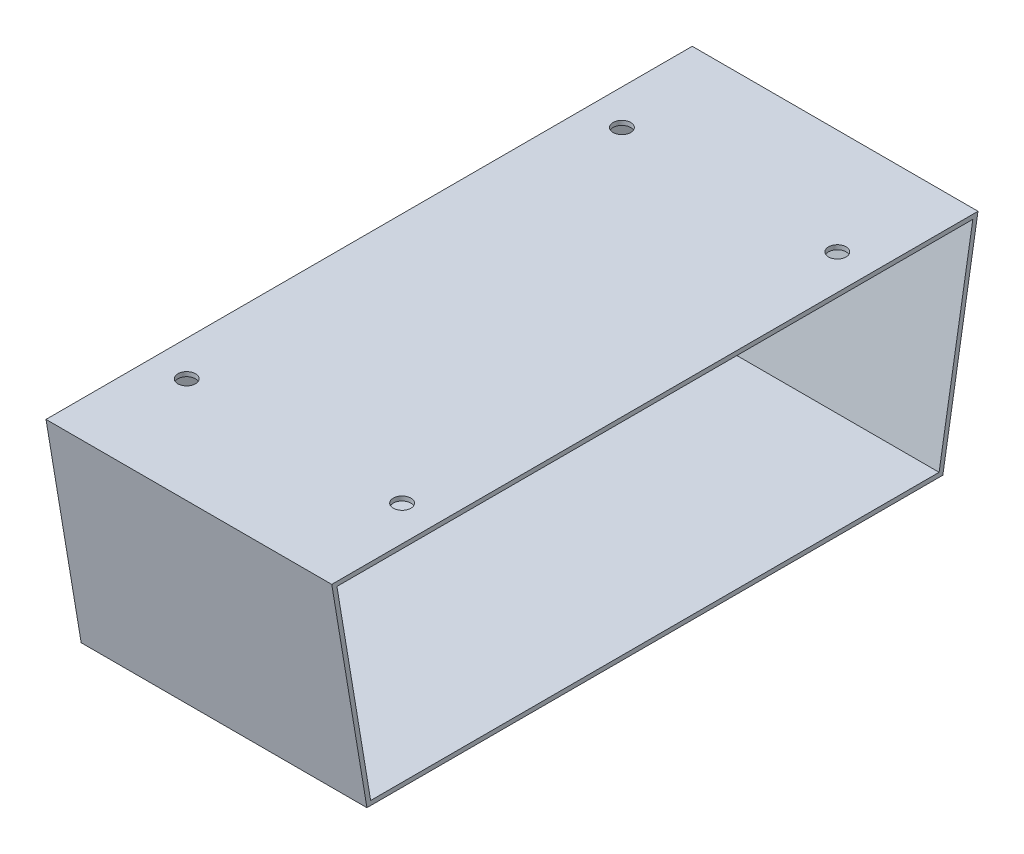
ISO-10303-21;
HEADER;
FILE_DESCRIPTION(('STEP AP214'),'2;1');
FILE_NAME('part.step','',(''),(''),'','','');
FILE_SCHEMA(('AUTOMOTIVE_DESIGN { 1 0 10303 214 1 1 1 1 }'));
ENDSEC;
DATA;
#1=APPLICATION_CONTEXT('core data for automotive mechanical design processes');
#2=APPLICATION_PROTOCOL_DEFINITION('international standard','automotive_design',2000,#1);
#3=PRODUCT_CONTEXT('',#1,'mechanical');
#4=PRODUCT('Part','Part','',(#3));
#5=PRODUCT_RELATED_PRODUCT_CATEGORY('part','',(#4));
#6=PRODUCT_DEFINITION_FORMATION('','',#4);
#7=PRODUCT_DEFINITION_CONTEXT('part definition',#1,'design');
#8=PRODUCT_DEFINITION('design','',#6,#7);
#9=PRODUCT_DEFINITION_SHAPE('','',#8);
#10=(LENGTH_UNIT() NAMED_UNIT(*) SI_UNIT(.MILLI.,.METRE.));
#11=(NAMED_UNIT(*) PLANE_ANGLE_UNIT() SI_UNIT($,.RADIAN.));
#12=(NAMED_UNIT(*) SI_UNIT($,.STERADIAN.) SOLID_ANGLE_UNIT());
#13=UNCERTAINTY_MEASURE_WITH_UNIT(LENGTH_MEASURE(1.E-05),#10,'distance_accuracy_value','');
#14=(GEOMETRIC_REPRESENTATION_CONTEXT(3) GLOBAL_UNCERTAINTY_ASSIGNED_CONTEXT((#13)) GLOBAL_UNIT_ASSIGNED_CONTEXT((#10,
#11,#12)) REPRESENTATION_CONTEXT('',''));
#15=CARTESIAN_POINT('',(0.,0.,0.));
#16=DIRECTION('',(0.,0.,1.));
#17=DIRECTION('',(1.,0.,0.));
#18=AXIS2_PLACEMENT_3D('',#15,#16,#17);
#19=CARTESIAN_POINT('',(3.175,16.7486577181208,-57.6081375838925));
#20=DIRECTION('',(0.,1.,0.));
#21=DIRECTION('',(0.,0.,1.));
#22=AXIS2_PLACEMENT_3D('',#19,#20,#21);
#23=PLANE('',#22);
#24=DIRECTION('',(0.,0.,-1.));
#25=VECTOR('',#24,1.);
#26=CARTESIAN_POINT('',(0.,16.7486577181208,-57.6081375838925));
#27=LINE('',#26,#25);
#28=CARTESIAN_POINT('',(0.,16.7486577181208,358.316862416107));
#29=VERTEX_POINT('',#28);
#30=CARTESIAN_POINT('',(0.,16.7486577181208,-57.6081375838925));
#31=VERTEX_POINT('',#30);
#32=EDGE_CURVE('E153',#29,#31,#27,.T.);
#33=ORIENTED_EDGE('',*,*,#32,.T.);
#34=DIRECTION('',(-1.,0.,0.));
#35=VECTOR('',#34,1.);
#36=CARTESIAN_POINT('',(3.175,16.7486577181208,-57.6081375838925));
#37=LINE('',#36,#35);
#38=CARTESIAN_POINT('',(206.375,16.7486577181208,-57.6081375838925));
#39=VERTEX_POINT('',#38);
#40=EDGE_CURVE('E11',#39,#31,#37,.T.);
#41=ORIENTED_EDGE('',*,*,#40,.F.);
#42=DIRECTION('',(0.,0.,-1.));
#43=VECTOR('',#42,1.);
#44=CARTESIAN_POINT('',(206.375,16.7486577181208,358.316862416107));
#45=LINE('',#44,#43);
#46=CARTESIAN_POINT('',(206.375,16.7486577181208,358.316862416107));
#47=VERTEX_POINT('',#46);
#48=EDGE_CURVE('E147',#47,#39,#45,.T.);
#49=ORIENTED_EDGE('',*,*,#48,.F.);
#50=DIRECTION('',(-1.,0.,0.));
#51=VECTOR('',#50,1.);
#52=CARTESIAN_POINT('',(3.175,16.7486577181208,358.316862416107));
#53=LINE('',#52,#51);
#54=EDGE_CURVE('E161',#47,#29,#53,.T.);
#55=ORIENTED_EDGE('',*,*,#54,.T.);
#56=EDGE_LOOP('',(#33,#41,#49,#55));
#57=FACE_BOUND('',#56,.T.);
#58=ADVANCED_FACE('F34',(#57),#23,.F.);
#59=CARTESIAN_POINT('',(3.175,169.148657718121,-83.0081375838925));
#60=DIRECTION('',(0.,0.164398987305357,0.986393923832144));
#61=DIRECTION('',(0.,-0.986393923832144,0.164398987305357));
#62=AXIS2_PLACEMENT_3D('',#59,#60,#61);
#63=PLANE('',#62);
#64=DIRECTION('',(0.,0.986393923832144,-0.164398987305357));
#65=VECTOR('',#64,1.);
#66=CARTESIAN_POINT('',(0.,169.148657718121,-83.0081375838925));
#67=LINE('',#66,#65);
#68=CARTESIAN_POINT('',(0.,169.148657718121,-83.0081375838925));
#69=VERTEX_POINT('',#68);
#70=EDGE_CURVE('E156',#31,#69,#67,.T.);
#71=ORIENTED_EDGE('',*,*,#70,.T.);
#72=DIRECTION('',(-1.,0.,0.));
#73=VECTOR('',#72,1.);
#74=CARTESIAN_POINT('',(3.175,169.148657718121,-83.0081375838925));
#75=LINE('',#74,#73);
#76=CARTESIAN_POINT('',(206.375,169.148657718121,-83.0081375838925));
#77=VERTEX_POINT('',#76);
#78=EDGE_CURVE('E41',#77,#69,#75,.T.);
#79=ORIENTED_EDGE('',*,*,#78,.F.);
#80=DIRECTION('',(0.,0.986393923832144,-0.164398987305357));
#81=VECTOR('',#80,1.);
#82=CARTESIAN_POINT('',(206.375,16.7486577181208,-57.6081375838925));
#83=LINE('',#82,#81);
#84=EDGE_CURVE('E150',#39,#77,#83,.T.);
#85=ORIENTED_EDGE('',*,*,#84,.F.);
#86=ORIENTED_EDGE('',*,*,#40,.T.);
#87=EDGE_LOOP('',(#71,#79,#85,#86));
#88=FACE_BOUND('',#87,.T.);
#89=ADVANCED_FACE('F179',(#88),#63,.F.);
#90=CARTESIAN_POINT('',(3.175,169.148657718121,383.716862416107));
#91=DIRECTION('',(0.,-1.,0.));
#92=DIRECTION('',(0.,0.,-1.));
#93=AXIS2_PLACEMENT_3D('',#90,#91,#92);
#94=PLANE('',#93);
#95=CARTESIAN_POINT('',(25.4,169.148657718121,-6.80813758389252));
#96=DIRECTION('',(0.,1.,0.));
#97=DIRECTION('',(0.,0.,1.));
#98=AXIS2_PLACEMENT_3D('',#95,#96,#97);
#99=CIRCLE('',#98,6.35);
#100=CARTESIAN_POINT('',(25.4,169.148657718121,-0.458137583892528));
#101=VERTEX_POINT('',#100);
#102=EDGE_CURVE('E247',#101,#101,#99,.T.);
#103=ORIENTED_EDGE('',*,*,#102,.F.);
#104=EDGE_LOOP('',(#103));
#105=FACE_BOUND('',#104,.T.);
#106=CARTESIAN_POINT('',(180.975,169.148657718121,-6.80813758389252));
#107=DIRECTION('',(0.,1.,0.));
#108=DIRECTION('',(0.,0.,1.));
#109=AXIS2_PLACEMENT_3D('',#106,#107,#108);
#110=CIRCLE('',#109,6.35);
#111=CARTESIAN_POINT('',(180.975,169.148657718121,-0.458137583892528));
#112=VERTEX_POINT('',#111);
#113=EDGE_CURVE('E239',#112,#112,#110,.T.);
#114=ORIENTED_EDGE('',*,*,#113,.F.);
#115=EDGE_LOOP('',(#114));
#116=FACE_BOUND('',#115,.T.);
#117=CARTESIAN_POINT('',(180.975,169.148657718121,307.516862416107));
#118=DIRECTION('',(0.,1.,0.));
#119=DIRECTION('',(0.,0.,-1.));
#120=AXIS2_PLACEMENT_3D('',#117,#118,#119);
#121=CIRCLE('',#120,6.35000000000002);
#122=CARTESIAN_POINT('',(180.975,169.148657718121,301.166862416107));
#123=VERTEX_POINT('',#122);
#124=EDGE_CURVE('E232',#123,#123,#121,.T.);
#125=ORIENTED_EDGE('',*,*,#124,.F.);
#126=EDGE_LOOP('',(#125));
#127=FACE_BOUND('',#126,.T.);
#128=CARTESIAN_POINT('',(25.4,169.148657718121,307.516862416107));
#129=DIRECTION('',(0.,1.,0.));
#130=DIRECTION('',(0.,0.,-1.));
#131=AXIS2_PLACEMENT_3D('',#128,#129,#130);
#132=CIRCLE('',#131,6.35000000000001);
#133=CARTESIAN_POINT('',(25.4,169.148657718121,301.166862416107));
#134=VERTEX_POINT('',#133);
#135=EDGE_CURVE('E236',#134,#134,#132,.T.);
#136=ORIENTED_EDGE('',*,*,#135,.F.);
#137=EDGE_LOOP('',(#136));
#138=FACE_BOUND('',#137,.T.);
#139=DIRECTION('',(0.,0.,1.));
#140=VECTOR('',#139,1.);
#141=CARTESIAN_POINT('',(0.,169.148657718121,383.716862416107));
#142=LINE('',#141,#140);
#143=CARTESIAN_POINT('',(0.,169.148657718121,383.716862416107));
#144=VERTEX_POINT('',#143);
#145=EDGE_CURVE('E158',#69,#144,#142,.T.);
#146=ORIENTED_EDGE('',*,*,#145,.T.);
#147=DIRECTION('',(-1.,0.,0.));
#148=VECTOR('',#147,1.);
#149=CARTESIAN_POINT('',(3.175,169.148657718121,383.716862416107));
#150=LINE('',#149,#148);
#151=CARTESIAN_POINT('',(206.375,169.148657718121,383.716862416107));
#152=VERTEX_POINT('',#151);
#153=EDGE_CURVE('E163',#152,#144,#150,.T.);
#154=ORIENTED_EDGE('',*,*,#153,.F.);
#155=DIRECTION('',(0.,0.,1.));
#156=VECTOR('',#155,1.);
#157=CARTESIAN_POINT('',(206.375,169.148657718121,-83.0081375838925));
#158=LINE('',#157,#156);
#159=EDGE_CURVE('E116',#77,#152,#158,.T.);
#160=ORIENTED_EDGE('',*,*,#159,.F.);
#161=ORIENTED_EDGE('',*,*,#78,.T.);
#162=EDGE_LOOP('',(#146,#154,#160,#161));
#163=FACE_BOUND('',#162,.T.);
#164=ADVANCED_FACE('F168',(#105,#116,#127,#138,#163),#94,.F.);
#165=CARTESIAN_POINT('',(3.175,16.7486577181208,358.316862416107));
#166=DIRECTION('',(0.,0.164398987305357,-0.986393923832144));
#167=DIRECTION('',(0.,0.986393923832144,0.164398987305357));
#168=AXIS2_PLACEMENT_3D('',#165,#166,#167);
#169=PLANE('',#168);
#170=DIRECTION('',(0.,-0.986393923832144,-0.164398987305357));
#171=VECTOR('',#170,1.);
#172=CARTESIAN_POINT('',(0.,16.7486577181208,358.316862416107));
#173=LINE('',#172,#171);
#174=EDGE_CURVE('E56',#144,#29,#173,.T.);
#175=ORIENTED_EDGE('',*,*,#174,.T.);
#176=ORIENTED_EDGE('',*,*,#54,.F.);
#177=DIRECTION('',(0.,-0.986393923832144,-0.164398987305357));
#178=VECTOR('',#177,1.);
#179=CARTESIAN_POINT('',(206.375,169.148657718121,383.716862416107));
#180=LINE('',#179,#178);
#181=EDGE_CURVE('E144',#152,#47,#180,.T.);
#182=ORIENTED_EDGE('',*,*,#181,.F.);
#183=ORIENTED_EDGE('',*,*,#153,.T.);
#184=EDGE_LOOP('',(#175,#176,#182,#183));
#185=FACE_BOUND('',#184,.T.);
#186=ADVANCED_FACE('F177',(#185),#169,.F.);
#187=CARTESIAN_POINT('',(0.,0.,0.));
#188=DIRECTION('',(-1.,0.,0.));
#189=DIRECTION('',(0.,0.,1.));
#190=AXIS2_PLACEMENT_3D('',#187,#188,#189);
#191=PLANE('',#190);
#192=ORIENTED_EDGE('',*,*,#32,.F.);
#193=ORIENTED_EDGE('',*,*,#174,.F.);
#194=ORIENTED_EDGE('',*,*,#145,.F.);
#195=ORIENTED_EDGE('',*,*,#70,.F.);
#196=EDGE_LOOP('',(#192,#193,#194,#195));
#197=FACE_BOUND('',#196,.T.);
#198=ADVANCED_FACE('F173',(#197),#191,.T.);
#199=CARTESIAN_POINT('',(206.375,0.,0.));
#200=DIRECTION('',(1.,0.,0.));
#201=DIRECTION('',(0.,0.,-1.));
#202=AXIS2_PLACEMENT_3D('',#199,#200,#201);
#203=PLANE('',#202);
#204=ORIENTED_EDGE('',*,*,#159,.T.);
#205=ORIENTED_EDGE('',*,*,#181,.T.);
#206=ORIENTED_EDGE('',*,*,#48,.T.);
#207=ORIENTED_EDGE('',*,*,#84,.T.);
#208=EDGE_LOOP('',(#204,#205,#206,#207));
#209=FACE_BOUND('',#208,.T.);
#210=DIRECTION('',(0.,0.986393923832144,-0.164398987305357));
#211=VECTOR('',#210,1.);
#212=CARTESIAN_POINT('',(206.375,19.9236577181208,-54.9185090782764));
#213=LINE('',#212,#211);
#214=CARTESIAN_POINT('',(206.375,19.9236577181208,-54.9185090782764));
#215=VERTEX_POINT('',#214);
#216=CARTESIAN_POINT('',(206.375,165.973657718121,-79.2601757449431));
#217=VERTEX_POINT('',#216);
#218=EDGE_CURVE('E108',#215,#217,#213,.T.);
#219=ORIENTED_EDGE('',*,*,#218,.F.);
#220=DIRECTION('',(0.,0.,-1.));
#221=VECTOR('',#220,1.);
#222=CARTESIAN_POINT('',(206.375,19.9236577181208,355.627233910491));
#223=LINE('',#222,#221);
#224=CARTESIAN_POINT('',(206.375,19.9236577181208,355.627233910491));
#225=VERTEX_POINT('',#224);
#226=EDGE_CURVE('E100',#225,#215,#223,.T.);
#227=ORIENTED_EDGE('',*,*,#226,.F.);
#228=DIRECTION('',(0.,-0.986393923832144,-0.164398987305357));
#229=VECTOR('',#228,1.);
#230=CARTESIAN_POINT('',(206.375,165.973657718121,379.968900577158));
#231=LINE('',#230,#229);
#232=CARTESIAN_POINT('',(206.375,165.973657718121,379.968900577158));
#233=VERTEX_POINT('',#232);
#234=EDGE_CURVE('E124',#233,#225,#231,.T.);
#235=ORIENTED_EDGE('',*,*,#234,.F.);
#236=DIRECTION('',(0.,0.,1.));
#237=VECTOR('',#236,1.);
#238=CARTESIAN_POINT('',(206.375,165.973657718121,-79.2601757449431));
#239=LINE('',#238,#237);
#240=EDGE_CURVE('E122',#217,#233,#239,.T.);
#241=ORIENTED_EDGE('',*,*,#240,.F.);
#242=EDGE_LOOP('',(#219,#227,#235,#241));
#243=FACE_BOUND('',#242,.T.);
#244=ADVANCED_FACE('F120',(#209,#243),#203,.T.);
#245=CARTESIAN_POINT('',(206.375,19.9236577181208,355.627233910491));
#246=DIRECTION('',(0.,1.,0.));
#247=DIRECTION('',(0.,0.,1.));
#248=AXIS2_PLACEMENT_3D('',#245,#246,#247);
#249=PLANE('',#248);
#250=DIRECTION('',(0.,0.,-1.));
#251=VECTOR('',#250,1.);
#252=CARTESIAN_POINT('',(3.175,19.9236577181208,355.627233910491));
#253=LINE('',#252,#251);
#254=CARTESIAN_POINT('',(3.175,19.9236577181208,355.627233910491));
#255=VERTEX_POINT('',#254);
#256=CARTESIAN_POINT('',(3.175,19.9236577181208,-54.9185090782764));
#257=VERTEX_POINT('',#256);
#258=EDGE_CURVE('E129',#255,#257,#253,.T.);
#259=ORIENTED_EDGE('',*,*,#258,.F.);
#260=DIRECTION('',(-1.,0.,0.));
#261=VECTOR('',#260,1.);
#262=CARTESIAN_POINT('',(206.375,19.9236577181208,355.627233910491));
#263=LINE('',#262,#261);
#264=EDGE_CURVE('E48',#225,#255,#263,.T.);
#265=ORIENTED_EDGE('',*,*,#264,.F.);
#266=ORIENTED_EDGE('',*,*,#226,.T.);
#267=DIRECTION('',(-1.,0.,0.));
#268=VECTOR('',#267,1.);
#269=CARTESIAN_POINT('',(206.375,19.9236577181208,-54.9185090782764));
#270=LINE('',#269,#268);
#271=EDGE_CURVE('E103',#215,#257,#270,.T.);
#272=ORIENTED_EDGE('',*,*,#271,.T.);
#273=EDGE_LOOP('',(#259,#265,#266,#272));
#274=FACE_BOUND('',#273,.T.);
#275=ADVANCED_FACE('F102',(#274),#249,.T.);
#276=CARTESIAN_POINT('',(206.375,19.9236577181208,-54.9185090782764));
#277=DIRECTION('',(0.,0.164398987305357,0.986393923832144));
#278=DIRECTION('',(0.,-0.986393923832144,0.164398987305357));
#279=AXIS2_PLACEMENT_3D('',#276,#277,#278);
#280=PLANE('',#279);
#281=DIRECTION('',(0.,0.986393923832144,-0.164398987305357));
#282=VECTOR('',#281,1.);
#283=CARTESIAN_POINT('',(3.175,19.9236577181208,-54.9185090782764));
#284=LINE('',#283,#282);
#285=CARTESIAN_POINT('',(3.175,165.973657718121,-79.2601757449431));
#286=VERTEX_POINT('',#285);
#287=EDGE_CURVE('E115',#257,#286,#284,.T.);
#288=ORIENTED_EDGE('',*,*,#287,.F.);
#289=ORIENTED_EDGE('',*,*,#271,.F.);
#290=ORIENTED_EDGE('',*,*,#218,.T.);
#291=DIRECTION('',(-1.,0.,0.));
#292=VECTOR('',#291,1.);
#293=CARTESIAN_POINT('',(206.375,165.973657718121,-79.2601757449431));
#294=LINE('',#293,#292);
#295=EDGE_CURVE('E117',#217,#286,#294,.T.);
#296=ORIENTED_EDGE('',*,*,#295,.T.);
#297=EDGE_LOOP('',(#288,#289,#290,#296));
#298=FACE_BOUND('',#297,.T.);
#299=ADVANCED_FACE('F112',(#298),#280,.T.);
#300=CARTESIAN_POINT('',(206.375,165.973657718121,-79.2601757449431));
#301=DIRECTION('',(0.,-1.,0.));
#302=DIRECTION('',(0.,0.,-1.));
#303=AXIS2_PLACEMENT_3D('',#300,#301,#302);
#304=PLANE('',#303);
#305=CARTESIAN_POINT('',(25.4,165.973657718121,-6.80813758389252));
#306=DIRECTION('',(0.,1.,0.));
#307=DIRECTION('',(0.,0.,1.));
#308=AXIS2_PLACEMENT_3D('',#305,#306,#307);
#309=CIRCLE('',#308,6.35);
#310=CARTESIAN_POINT('',(25.4,165.973657718121,-0.458137583892528));
#311=VERTEX_POINT('',#310);
#312=EDGE_CURVE('E244',#311,#311,#309,.T.);
#313=ORIENTED_EDGE('',*,*,#312,.T.);
#314=EDGE_LOOP('',(#313));
#315=FACE_BOUND('',#314,.T.);
#316=CARTESIAN_POINT('',(180.975,165.973657718121,-6.80813758389252));
#317=DIRECTION('',(0.,1.,0.));
#318=DIRECTION('',(0.,0.,1.));
#319=AXIS2_PLACEMENT_3D('',#316,#317,#318);
#320=CIRCLE('',#319,6.35);
#321=CARTESIAN_POINT('',(180.975,165.973657718121,-0.458137583892528));
#322=VERTEX_POINT('',#321);
#323=EDGE_CURVE('E234',#322,#322,#320,.T.);
#324=ORIENTED_EDGE('',*,*,#323,.T.);
#325=EDGE_LOOP('',(#324));
#326=FACE_BOUND('',#325,.T.);
#327=CARTESIAN_POINT('',(180.975,165.973657718121,307.516862416107));
#328=DIRECTION('',(0.,1.,0.));
#329=DIRECTION('',(0.,0.,-1.));
#330=AXIS2_PLACEMENT_3D('',#327,#328,#329);
#331=CIRCLE('',#330,6.35000000000002);
#332=CARTESIAN_POINT('',(180.975,165.973657718121,301.166862416107));
#333=VERTEX_POINT('',#332);
#334=EDGE_CURVE('E229',#333,#333,#331,.T.);
#335=ORIENTED_EDGE('',*,*,#334,.T.);
#336=EDGE_LOOP('',(#335));
#337=FACE_BOUND('',#336,.T.);
#338=CARTESIAN_POINT('',(25.4,165.973657718121,307.516862416107));
#339=DIRECTION('',(0.,1.,0.));
#340=DIRECTION('',(0.,0.,-1.));
#341=AXIS2_PLACEMENT_3D('',#338,#339,#340);
#342=CIRCLE('',#341,6.35000000000001);
#343=CARTESIAN_POINT('',(25.4,165.973657718121,301.166862416107));
#344=VERTEX_POINT('',#343);
#345=EDGE_CURVE('E131',#344,#344,#342,.T.);
#346=ORIENTED_EDGE('',*,*,#345,.T.);
#347=EDGE_LOOP('',(#346));
#348=FACE_BOUND('',#347,.T.);
#349=DIRECTION('',(0.,0.,1.));
#350=VECTOR('',#349,1.);
#351=CARTESIAN_POINT('',(3.175,165.973657718121,-79.2601757449431));
#352=LINE('',#351,#350);
#353=CARTESIAN_POINT('',(3.175,165.973657718121,379.968900577158));
#354=VERTEX_POINT('',#353);
#355=EDGE_CURVE('E133',#286,#354,#352,.T.);
#356=ORIENTED_EDGE('',*,*,#355,.F.);
#357=ORIENTED_EDGE('',*,*,#295,.F.);
#358=ORIENTED_EDGE('',*,*,#240,.T.);
#359=DIRECTION('',(-1.,0.,0.));
#360=VECTOR('',#359,1.);
#361=CARTESIAN_POINT('',(206.375,165.973657718121,379.968900577158));
#362=LINE('',#361,#360);
#363=EDGE_CURVE('E139',#233,#354,#362,.T.);
#364=ORIENTED_EDGE('',*,*,#363,.T.);
#365=EDGE_LOOP('',(#356,#357,#358,#364));
#366=FACE_BOUND('',#365,.T.);
#367=ADVANCED_FACE('F204',(#315,#326,#337,#348,#366),#304,.T.);
#368=CARTESIAN_POINT('',(206.375,165.973657718121,379.968900577158));
#369=DIRECTION('',(0.,0.164398987305357,-0.986393923832144));
#370=DIRECTION('',(0.,0.986393923832144,0.164398987305357));
#371=AXIS2_PLACEMENT_3D('',#368,#369,#370);
#372=PLANE('',#371);
#373=DIRECTION('',(0.,-0.986393923832144,-0.164398987305357));
#374=VECTOR('',#373,1.);
#375=CARTESIAN_POINT('',(3.175,165.973657718121,379.968900577158));
#376=LINE('',#375,#374);
#377=EDGE_CURVE('E109',#354,#255,#376,.T.);
#378=ORIENTED_EDGE('',*,*,#377,.F.);
#379=ORIENTED_EDGE('',*,*,#363,.F.);
#380=ORIENTED_EDGE('',*,*,#234,.T.);
#381=ORIENTED_EDGE('',*,*,#264,.T.);
#382=EDGE_LOOP('',(#378,#379,#380,#381));
#383=FACE_BOUND('',#382,.T.);
#384=ADVANCED_FACE('F196',(#383),#372,.T.);
#385=CARTESIAN_POINT('',(3.175,0.,0.));
#386=DIRECTION('',(-1.,0.,0.));
#387=DIRECTION('',(0.,0.,1.));
#388=AXIS2_PLACEMENT_3D('',#385,#386,#387);
#389=PLANE('',#388);
#390=ORIENTED_EDGE('',*,*,#377,.T.);
#391=ORIENTED_EDGE('',*,*,#258,.T.);
#392=ORIENTED_EDGE('',*,*,#287,.T.);
#393=ORIENTED_EDGE('',*,*,#355,.T.);
#394=EDGE_LOOP('',(#390,#391,#392,#393));
#395=FACE_BOUND('',#394,.T.);
#396=ADVANCED_FACE('F192',(#395),#389,.F.);
#397=CARTESIAN_POINT('',(25.4,165.973657718121,307.516862416107));
#398=DIRECTION('',(0.,1.,0.));
#399=DIRECTION('',(0.,0.,1.));
#400=AXIS2_PLACEMENT_3D('',#397,#398,#399);
#401=CYLINDRICAL_SURFACE('',#400,6.35000000000001);
#402=ORIENTED_EDGE('',*,*,#345,.F.);
#403=EDGE_LOOP('',(#402));
#404=FACE_BOUND('',#403,.T.);
#405=ORIENTED_EDGE('',*,*,#135,.T.);
#406=EDGE_LOOP('',(#405));
#407=FACE_BOUND('',#406,.T.);
#408=ADVANCED_FACE('F195',(#404,#407),#401,.F.);
#409=CARTESIAN_POINT('',(180.975,165.973657718121,307.516862416107));
#410=DIRECTION('',(0.,1.,0.));
#411=DIRECTION('',(0.,0.,1.));
#412=AXIS2_PLACEMENT_3D('',#409,#410,#411);
#413=CYLINDRICAL_SURFACE('',#412,6.35000000000002);
#414=ORIENTED_EDGE('',*,*,#334,.F.);
#415=EDGE_LOOP('',(#414));
#416=FACE_BOUND('',#415,.T.);
#417=ORIENTED_EDGE('',*,*,#124,.T.);
#418=EDGE_LOOP('',(#417));
#419=FACE_BOUND('',#418,.T.);
#420=ADVANCED_FACE('F212',(#416,#419),#413,.F.);
#421=CARTESIAN_POINT('',(180.975,165.973657718121,-6.80813758389252));
#422=DIRECTION('',(0.,1.,0.));
#423=DIRECTION('',(0.,0.,1.));
#424=AXIS2_PLACEMENT_3D('',#421,#422,#423);
#425=CYLINDRICAL_SURFACE('',#424,6.35);
#426=ORIENTED_EDGE('',*,*,#323,.F.);
#427=EDGE_LOOP('',(#426));
#428=FACE_BOUND('',#427,.T.);
#429=ORIENTED_EDGE('',*,*,#113,.T.);
#430=EDGE_LOOP('',(#429));
#431=FACE_BOUND('',#430,.T.);
#432=ADVANCED_FACE('F217',(#428,#431),#425,.F.);
#433=CARTESIAN_POINT('',(25.4,165.973657718121,-6.80813758389252));
#434=DIRECTION('',(0.,1.,0.));
#435=DIRECTION('',(0.,0.,1.));
#436=AXIS2_PLACEMENT_3D('',#433,#434,#435);
#437=CYLINDRICAL_SURFACE('',#436,6.35);
#438=ORIENTED_EDGE('',*,*,#312,.F.);
#439=EDGE_LOOP('',(#438));
#440=FACE_BOUND('',#439,.T.);
#441=ORIENTED_EDGE('',*,*,#102,.T.);
#442=EDGE_LOOP('',(#441));
#443=FACE_BOUND('',#442,.T.);
#444=ADVANCED_FACE('F214',(#440,#443),#437,.F.);
#445=CLOSED_SHELL('',(#58,#89,#164,#186,#198,#244,#275,#299,#367,#384,#396,#408,#420,#432,#444));
#446=MANIFOLD_SOLID_BREP('B2',#445);
#447=ADVANCED_BREP_SHAPE_REPRESENTATION('',(#18,#446),#14);
#448=SHAPE_DEFINITION_REPRESENTATION(#9,#447);
ENDSEC;
END-ISO-10303-21;
